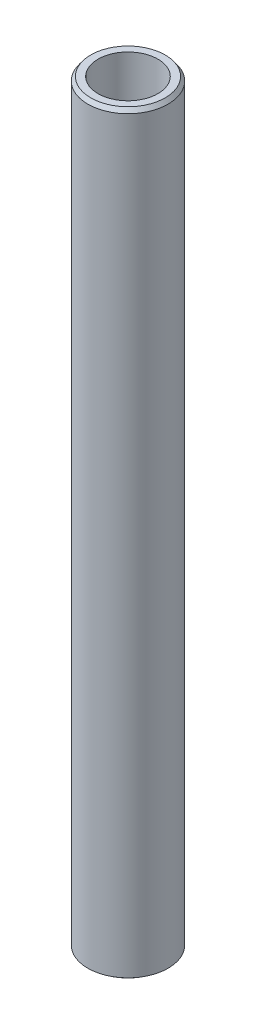
ISO-10303-21;
HEADER;
FILE_DESCRIPTION(('STEP AP214'),'2;1');
FILE_NAME('part.step','',(''),(''),'','','');
FILE_SCHEMA(('AUTOMOTIVE_DESIGN { 1 0 10303 214 1 1 1 1 }'));
ENDSEC;
DATA;
#1=APPLICATION_CONTEXT('core data for automotive mechanical design processes');
#2=APPLICATION_PROTOCOL_DEFINITION('international standard','automotive_design',2000,#1);
#3=PRODUCT_CONTEXT('',#1,'mechanical');
#4=PRODUCT('Part','Part','',(#3));
#5=PRODUCT_RELATED_PRODUCT_CATEGORY('part','',(#4));
#6=PRODUCT_DEFINITION_FORMATION('','',#4);
#7=PRODUCT_DEFINITION_CONTEXT('part definition',#1,'design');
#8=PRODUCT_DEFINITION('design','',#6,#7);
#9=PRODUCT_DEFINITION_SHAPE('','',#8);
#10=(LENGTH_UNIT() NAMED_UNIT(*) SI_UNIT(.MILLI.,.METRE.));
#11=(NAMED_UNIT(*) PLANE_ANGLE_UNIT() SI_UNIT($,.RADIAN.));
#12=(NAMED_UNIT(*) SI_UNIT($,.STERADIAN.) SOLID_ANGLE_UNIT());
#13=UNCERTAINTY_MEASURE_WITH_UNIT(LENGTH_MEASURE(1.E-05),#10,'distance_accuracy_value','');
#14=(GEOMETRIC_REPRESENTATION_CONTEXT(3) GLOBAL_UNCERTAINTY_ASSIGNED_CONTEXT((#13)) GLOBAL_UNIT_ASSIGNED_CONTEXT((#10,
#11,#12)) REPRESENTATION_CONTEXT('',''));
#15=CARTESIAN_POINT('',(0.,0.,0.));
#16=DIRECTION('',(0.,0.,1.));
#17=DIRECTION('',(1.,0.,0.));
#18=AXIS2_PLACEMENT_3D('',#15,#16,#17);
#19=CARTESIAN_POINT('',(0.,470.416780712655,0.));
#20=DIRECTION('',(0.,-1.,0.));
#21=DIRECTION('',(0.,0.,-1.));
#22=AXIS2_PLACEMENT_3D('',#19,#20,#21);
#23=CYLINDRICAL_SURFACE('',#22,25.);
#24=CARTESIAN_POINT('',(0.,467.937655221392,0.));
#25=DIRECTION('',(0.,1.,0.));
#26=DIRECTION('',(0.,0.,1.));
#27=AXIS2_PLACEMENT_3D('',#24,#25,#26);
#28=CIRCLE('',#27,25.);
#29=CARTESIAN_POINT('',(0.,467.937655221392,25.));
#30=VERTEX_POINT('',#29);
#31=EDGE_CURVE('E50',#30,#30,#28,.F.);
#32=ORIENTED_EDGE('',*,*,#31,.T.);
#33=EDGE_LOOP('',(#32));
#34=FACE_BOUND('',#33,.T.);
#35=CARTESIAN_POINT('',(0.,1.8219367885956,0.));
#36=DIRECTION('',(0.,1.,0.));
#37=DIRECTION('',(0.,0.,1.));
#38=AXIS2_PLACEMENT_3D('',#35,#36,#37);
#39=CIRCLE('',#38,25.);
#40=CARTESIAN_POINT('',(0.,1.8219367885956,25.));
#41=VERTEX_POINT('',#40);
#42=EDGE_CURVE('E51',#41,#41,#39,.T.);
#43=ORIENTED_EDGE('',*,*,#42,.T.);
#44=EDGE_LOOP('',(#43));
#45=FACE_BOUND('',#44,.T.);
#46=ADVANCED_FACE('F39',(#34,#45),#23,.T.);
#47=CARTESIAN_POINT('',(0.,470.416780712655,0.));
#48=DIRECTION('',(0.,1.,0.));
#49=DIRECTION('',(0.,0.,1.));
#50=AXIS2_PLACEMENT_3D('',#47,#48,#49);
#51=PLANE('',#50);
#52=CARTESIAN_POINT('',(0.,470.416780712655,0.));
#53=DIRECTION('',(0.,1.,0.));
#54=DIRECTION('',(0.,0.,1.));
#55=AXIS2_PLACEMENT_3D('',#52,#53,#54);
#56=CIRCLE('',#55,23.1780632114044);
#57=CARTESIAN_POINT('',(0.,470.416780712655,23.1780632114044));
#58=VERTEX_POINT('',#57);
#59=EDGE_CURVE('E54',#58,#58,#56,.T.);
#60=ORIENTED_EDGE('',*,*,#59,.T.);
#61=EDGE_LOOP('',(#60));
#62=FACE_BOUND('',#61,.T.);
#63=CARTESIAN_POINT('',(0.,470.416780712655,0.));
#64=DIRECTION('',(0.,1.,0.));
#65=DIRECTION('',(0.,0.,1.));
#66=AXIS2_PLACEMENT_3D('',#63,#64,#65);
#67=CIRCLE('',#66,18.6426091398829);
#68=CARTESIAN_POINT('',(0.,470.416780712655,18.6426091398829));
#69=VERTEX_POINT('',#68);
#70=EDGE_CURVE('E58',#69,#69,#67,.T.);
#71=ORIENTED_EDGE('',*,*,#70,.F.);
#72=EDGE_LOOP('',(#71));
#73=FACE_BOUND('',#72,.T.);
#74=ADVANCED_FACE('F69',(#62,#73),#51,.T.);
#75=CARTESIAN_POINT('',(0.,0.,0.));
#76=DIRECTION('',(0.,1.,0.));
#77=DIRECTION('',(0.,0.,1.));
#78=AXIS2_PLACEMENT_3D('',#75,#76,#77);
#79=PLANE('',#78);
#80=CARTESIAN_POINT('',(0.,0.,0.));
#81=DIRECTION('',(0.,1.,0.));
#82=DIRECTION('',(0.,0.,1.));
#83=AXIS2_PLACEMENT_3D('',#80,#81,#82);
#84=CIRCLE('',#83,22.5208745087369);
#85=CARTESIAN_POINT('',(0.,0.,22.5208745087369));
#86=VERTEX_POINT('',#85);
#87=EDGE_CURVE('E10',#86,#86,#84,.F.);
#88=ORIENTED_EDGE('',*,*,#87,.T.);
#89=EDGE_LOOP('',(#88));
#90=FACE_BOUND('',#89,.T.);
#91=CARTESIAN_POINT('',(0.,0.,0.));
#92=DIRECTION('',(0.,1.,0.));
#93=DIRECTION('',(0.,0.,1.));
#94=AXIS2_PLACEMENT_3D('',#91,#92,#93);
#95=CIRCLE('',#94,18.6426091398829);
#96=CARTESIAN_POINT('',(0.,0.,18.6426091398829));
#97=VERTEX_POINT('',#96);
#98=EDGE_CURVE('E63',#97,#97,#95,.T.);
#99=ORIENTED_EDGE('',*,*,#98,.T.);
#100=EDGE_LOOP('',(#99));
#101=FACE_BOUND('',#100,.T.);
#102=ADVANCED_FACE('F75',(#90,#101),#79,.F.);
#103=CARTESIAN_POINT('',(0.,470.416780712655,0.));
#104=DIRECTION('',(0.,-1.,0.));
#105=DIRECTION('',(0.,0.,-1.));
#106=AXIS2_PLACEMENT_3D('',#103,#104,#105);
#107=CYLINDRICAL_SURFACE('',#106,18.6426091398829);
#108=ORIENTED_EDGE('',*,*,#70,.T.);
#109=EDGE_LOOP('',(#108));
#110=FACE_BOUND('',#109,.T.);
#111=ORIENTED_EDGE('',*,*,#98,.F.);
#112=EDGE_LOOP('',(#111));
#113=FACE_BOUND('',#112,.T.);
#114=ADVANCED_FACE('F70',(#110,#113),#107,.F.);
#115=CARTESIAN_POINT('',(0.,470.416780712655,0.));
#116=DIRECTION('',(0.,-1.,0.));
#117=DIRECTION('',(0.,0.,-1.));
#118=AXIS2_PLACEMENT_3D('',#115,#116,#117);
#119=CONICAL_SURFACE('',#118,23.1780632114044,0.633774053649063);
#120=ORIENTED_EDGE('',*,*,#31,.F.);
#121=EDGE_LOOP('',(#120));
#122=FACE_BOUND('',#121,.T.);
#123=ORIENTED_EDGE('',*,*,#59,.F.);
#124=EDGE_LOOP('',(#123));
#125=FACE_BOUND('',#124,.T.);
#126=ADVANCED_FACE('F81',(#122,#125),#119,.T.);
#127=CARTESIAN_POINT('',(0.,1.8219367885956,0.));
#128=DIRECTION('',(0.,1.,0.));
#129=DIRECTION('',(0.,0.,1.));
#130=AXIS2_PLACEMENT_3D('',#127,#128,#129);
#131=CONICAL_SURFACE('',#130,25.,0.937022273145846);
#132=ORIENTED_EDGE('',*,*,#87,.F.);
#133=EDGE_LOOP('',(#132));
#134=FACE_BOUND('',#133,.T.);
#135=ORIENTED_EDGE('',*,*,#42,.F.);
#136=EDGE_LOOP('',(#135));
#137=FACE_BOUND('',#136,.T.);
#138=ADVANCED_FACE('F45',(#134,#137),#131,.T.);
#139=CLOSED_SHELL('',(#46,#74,#102,#114,#126,#138));
#140=MANIFOLD_SOLID_BREP('B2',#139);
#141=ADVANCED_BREP_SHAPE_REPRESENTATION('',(#18,#140),#14);
#142=SHAPE_DEFINITION_REPRESENTATION(#9,#141);
ENDSEC;
END-ISO-10303-21;
